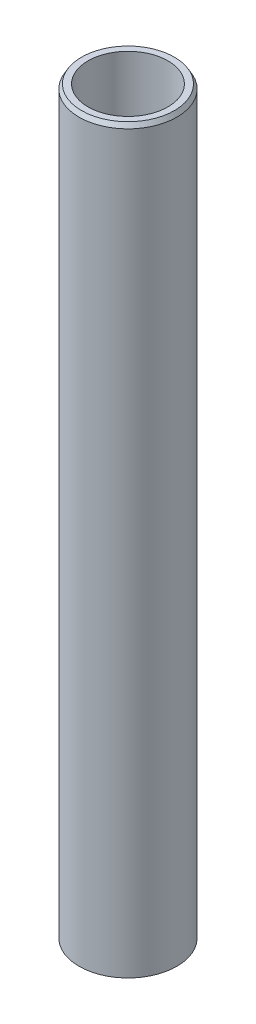
ISO-10303-21;
HEADER;
FILE_DESCRIPTION(('STEP AP214'),'2;1');
FILE_NAME('part.step','',(''),(''),'','','');
FILE_SCHEMA(('AUTOMOTIVE_DESIGN { 1 0 10303 214 1 1 1 1 }'));
ENDSEC;
DATA;
#1=APPLICATION_CONTEXT('core data for automotive mechanical design processes');
#2=APPLICATION_PROTOCOL_DEFINITION('international standard','automotive_design',2000,#1);
#3=PRODUCT_CONTEXT('',#1,'mechanical');
#4=PRODUCT('Part','Part','',(#3));
#5=PRODUCT_RELATED_PRODUCT_CATEGORY('part','',(#4));
#6=PRODUCT_DEFINITION_FORMATION('','',#4);
#7=PRODUCT_DEFINITION_CONTEXT('part definition',#1,'design');
#8=PRODUCT_DEFINITION('design','',#6,#7);
#9=PRODUCT_DEFINITION_SHAPE('','',#8);
#10=(LENGTH_UNIT() NAMED_UNIT(*) SI_UNIT(.MILLI.,.METRE.));
#11=(NAMED_UNIT(*) PLANE_ANGLE_UNIT() SI_UNIT($,.RADIAN.));
#12=(NAMED_UNIT(*) SI_UNIT($,.STERADIAN.) SOLID_ANGLE_UNIT());
#13=UNCERTAINTY_MEASURE_WITH_UNIT(LENGTH_MEASURE(1.E-05),#10,'distance_accuracy_value','');
#14=(GEOMETRIC_REPRESENTATION_CONTEXT(3) GLOBAL_UNCERTAINTY_ASSIGNED_CONTEXT((#13)) GLOBAL_UNIT_ASSIGNED_CONTEXT((#10,
#11,#12)) REPRESENTATION_CONTEXT('',''));
#15=CARTESIAN_POINT('',(0.,0.,0.));
#16=DIRECTION('',(0.,0.,1.));
#17=DIRECTION('',(1.,0.,0.));
#18=AXIS2_PLACEMENT_3D('',#15,#16,#17);
#19=CARTESIAN_POINT('',(0.,417.331183637228,0.));
#20=DIRECTION('',(0.,-1.,0.));
#21=DIRECTION('',(0.,0.,-1.));
#22=AXIS2_PLACEMENT_3D('',#19,#20,#21);
#23=CYLINDRICAL_SURFACE('',#22,27.5);
#24=CARTESIAN_POINT('',(0.,414.857827328083,0.));
#25=DIRECTION('',(0.,1.,0.));
#26=DIRECTION('',(0.,0.,1.));
#27=AXIS2_PLACEMENT_3D('',#24,#25,#26);
#28=CIRCLE('',#27,27.5);
#29=CARTESIAN_POINT('',(0.,414.857827328083,27.5));
#30=VERTEX_POINT('',#29);
#31=EDGE_CURVE('E50',#30,#30,#28,.F.);
#32=ORIENTED_EDGE('',*,*,#31,.T.);
#33=EDGE_LOOP('',(#32));
#34=FACE_BOUND('',#33,.T.);
#35=CARTESIAN_POINT('',(0.,1.4279929308868,0.));
#36=DIRECTION('',(0.,1.,0.));
#37=DIRECTION('',(0.,0.,1.));
#38=AXIS2_PLACEMENT_3D('',#35,#36,#37);
#39=CIRCLE('',#38,27.5);
#40=CARTESIAN_POINT('',(0.,1.4279929308868,27.5));
#41=VERTEX_POINT('',#40);
#42=EDGE_CURVE('E51',#41,#41,#39,.T.);
#43=ORIENTED_EDGE('',*,*,#42,.T.);
#44=EDGE_LOOP('',(#43));
#45=FACE_BOUND('',#44,.T.);
#46=ADVANCED_FACE('F39',(#34,#45),#23,.T.);
#47=CARTESIAN_POINT('',(0.,417.331183637228,0.));
#48=DIRECTION('',(0.,1.,0.));
#49=DIRECTION('',(0.,0.,1.));
#50=AXIS2_PLACEMENT_3D('',#47,#48,#49);
#51=PLANE('',#50);
#52=CARTESIAN_POINT('',(0.,417.331183637228,0.));
#53=DIRECTION('',(0.,1.,0.));
#54=DIRECTION('',(0.,0.,1.));
#55=AXIS2_PLACEMENT_3D('',#52,#53,#54);
#56=CIRCLE('',#55,26.0720070691132);
#57=CARTESIAN_POINT('',(0.,417.331183637228,26.0720070691132));
#58=VERTEX_POINT('',#57);
#59=EDGE_CURVE('E54',#58,#58,#56,.T.);
#60=ORIENTED_EDGE('',*,*,#59,.T.);
#61=EDGE_LOOP('',(#60));
#62=FACE_BOUND('',#61,.T.);
#63=CARTESIAN_POINT('',(0.,417.331183637228,0.));
#64=DIRECTION('',(0.,1.,0.));
#65=DIRECTION('',(0.,0.,1.));
#66=AXIS2_PLACEMENT_3D('',#63,#64,#65);
#67=CIRCLE('',#66,22.455756567699);
#68=CARTESIAN_POINT('',(0.,417.331183637228,22.455756567699));
#69=VERTEX_POINT('',#68);
#70=EDGE_CURVE('E58',#69,#69,#67,.T.);
#71=ORIENTED_EDGE('',*,*,#70,.F.);
#72=EDGE_LOOP('',(#71));
#73=FACE_BOUND('',#72,.T.);
#74=ADVANCED_FACE('F69',(#62,#73),#51,.T.);
#75=CARTESIAN_POINT('',(0.,0.,0.));
#76=DIRECTION('',(0.,1.,0.));
#77=DIRECTION('',(0.,0.,1.));
#78=AXIS2_PLACEMENT_3D('',#75,#76,#77);
#79=PLANE('',#78);
#80=CARTESIAN_POINT('',(0.,0.,0.));
#81=DIRECTION('',(0.,1.,0.));
#82=DIRECTION('',(0.,0.,1.));
#83=AXIS2_PLACEMENT_3D('',#80,#81,#82);
#84=CIRCLE('',#83,25.0266436908549);
#85=CARTESIAN_POINT('',(0.,0.,25.0266436908549));
#86=VERTEX_POINT('',#85);
#87=EDGE_CURVE('E10',#86,#86,#84,.F.);
#88=ORIENTED_EDGE('',*,*,#87,.T.);
#89=EDGE_LOOP('',(#88));
#90=FACE_BOUND('',#89,.T.);
#91=CARTESIAN_POINT('',(0.,0.,0.));
#92=DIRECTION('',(0.,1.,0.));
#93=DIRECTION('',(0.,0.,1.));
#94=AXIS2_PLACEMENT_3D('',#91,#92,#93);
#95=CIRCLE('',#94,22.455756567699);
#96=CARTESIAN_POINT('',(0.,0.,22.455756567699));
#97=VERTEX_POINT('',#96);
#98=EDGE_CURVE('E63',#97,#97,#95,.T.);
#99=ORIENTED_EDGE('',*,*,#98,.T.);
#100=EDGE_LOOP('',(#99));
#101=FACE_BOUND('',#100,.T.);
#102=ADVANCED_FACE('F75',(#90,#101),#79,.F.);
#103=CARTESIAN_POINT('',(0.,417.331183637228,0.));
#104=DIRECTION('',(0.,-1.,0.));
#105=DIRECTION('',(0.,0.,-1.));
#106=AXIS2_PLACEMENT_3D('',#103,#104,#105);
#107=CYLINDRICAL_SURFACE('',#106,22.455756567699);
#108=ORIENTED_EDGE('',*,*,#70,.T.);
#109=EDGE_LOOP('',(#108));
#110=FACE_BOUND('',#109,.T.);
#111=ORIENTED_EDGE('',*,*,#98,.F.);
#112=EDGE_LOOP('',(#111));
#113=FACE_BOUND('',#112,.T.);
#114=ADVANCED_FACE('F70',(#110,#113),#107,.F.);
#115=CARTESIAN_POINT('',(0.,417.331183637228,0.));
#116=DIRECTION('',(0.,-1.,0.));
#117=DIRECTION('',(0.,0.,-1.));
#118=AXIS2_PLACEMENT_3D('',#115,#116,#117);
#119=CONICAL_SURFACE('',#118,26.0720070691132,0.523598775598292);
#120=ORIENTED_EDGE('',*,*,#31,.F.);
#121=EDGE_LOOP('',(#120));
#122=FACE_BOUND('',#121,.T.);
#123=ORIENTED_EDGE('',*,*,#59,.F.);
#124=EDGE_LOOP('',(#123));
#125=FACE_BOUND('',#124,.T.);
#126=ADVANCED_FACE('F81',(#122,#125),#119,.T.);
#127=CARTESIAN_POINT('',(0.,1.4279929308868,0.));
#128=DIRECTION('',(0.,1.,0.));
#129=DIRECTION('',(0.,0.,1.));
#130=AXIS2_PLACEMENT_3D('',#127,#128,#129);
#131=CONICAL_SURFACE('',#130,27.5,1.04719755119659);
#132=ORIENTED_EDGE('',*,*,#87,.F.);
#133=EDGE_LOOP('',(#132));
#134=FACE_BOUND('',#133,.T.);
#135=ORIENTED_EDGE('',*,*,#42,.F.);
#136=EDGE_LOOP('',(#135));
#137=FACE_BOUND('',#136,.T.);
#138=ADVANCED_FACE('F45',(#134,#137),#131,.T.);
#139=CLOSED_SHELL('',(#46,#74,#102,#114,#126,#138));
#140=MANIFOLD_SOLID_BREP('B2',#139);
#141=ADVANCED_BREP_SHAPE_REPRESENTATION('',(#18,#140),#14);
#142=SHAPE_DEFINITION_REPRESENTATION(#9,#141);
ENDSEC;
END-ISO-10303-21;
